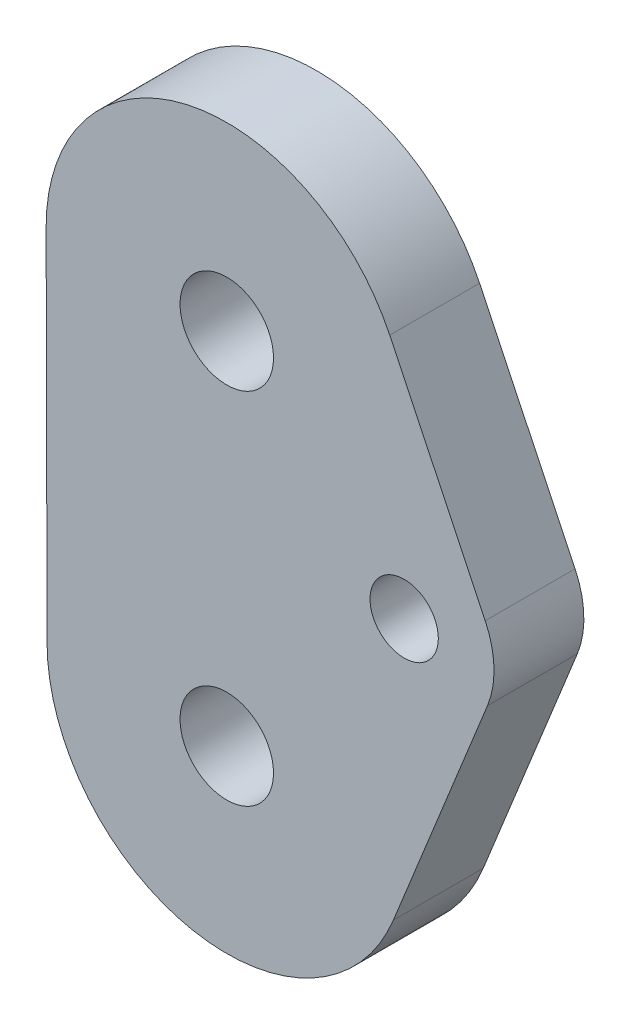
ISO-10303-21;
HEADER;
FILE_DESCRIPTION(('STEP AP214'),'2;1');
FILE_NAME('part.step','',(''),(''),'','','');
FILE_SCHEMA(('AUTOMOTIVE_DESIGN { 1 0 10303 214 1 1 1 1 }'));
ENDSEC;
DATA;
#1=APPLICATION_CONTEXT('core data for automotive mechanical design processes');
#2=APPLICATION_PROTOCOL_DEFINITION('international standard','automotive_design',2000,#1);
#3=PRODUCT_CONTEXT('',#1,'mechanical');
#4=PRODUCT('Part','Part','',(#3));
#5=PRODUCT_RELATED_PRODUCT_CATEGORY('part','',(#4));
#6=PRODUCT_DEFINITION_FORMATION('','',#4);
#7=PRODUCT_DEFINITION_CONTEXT('part definition',#1,'design');
#8=PRODUCT_DEFINITION('design','',#6,#7);
#9=PRODUCT_DEFINITION_SHAPE('','',#8);
#10=(LENGTH_UNIT() NAMED_UNIT(*) SI_UNIT(.MILLI.,.METRE.));
#11=(NAMED_UNIT(*) PLANE_ANGLE_UNIT() SI_UNIT($,.RADIAN.));
#12=(NAMED_UNIT(*) SI_UNIT($,.STERADIAN.) SOLID_ANGLE_UNIT());
#13=UNCERTAINTY_MEASURE_WITH_UNIT(LENGTH_MEASURE(1.E-05),#10,'distance_accuracy_value','');
#14=(GEOMETRIC_REPRESENTATION_CONTEXT(3) GLOBAL_UNCERTAINTY_ASSIGNED_CONTEXT((#13)) GLOBAL_UNIT_ASSIGNED_CONTEXT((#10,
#11,#12)) REPRESENTATION_CONTEXT('',''));
#15=CARTESIAN_POINT('',(0.,0.,0.));
#16=DIRECTION('',(0.,0.,1.));
#17=DIRECTION('',(1.,0.,0.));
#18=AXIS2_PLACEMENT_3D('',#15,#16,#17);
#19=CARTESIAN_POINT('',(56.9858620115287,-53.4430988360536,6.35));
#20=DIRECTION('',(0.,0.,1.));
#21=DIRECTION('',(1.,0.,0.));
#22=AXIS2_PLACEMENT_3D('',#19,#20,#21);
#23=PLANE('',#22);
#24=CARTESIAN_POINT('',(44.45,-67.508733918,6.35));
#25=DIRECTION('',(0.,0.,1.));
#26=DIRECTION('',(1.,0.,0.));
#27=AXIS2_PLACEMENT_3D('',#24,#25,#26);
#28=CIRCLE('',#27,3.30199999999999);
#29=CARTESIAN_POINT('',(47.752,-67.508733918,6.35));
#30=VERTEX_POINT('',#29);
#31=EDGE_CURVE('E187',#30,#30,#28,.T.);
#32=ORIENTED_EDGE('',*,*,#31,.F.);
#33=EDGE_LOOP('',(#32));
#34=FACE_BOUND('',#33,.T.);
#35=CARTESIAN_POINT('',(56.9858620115287,-53.4430988360536,6.35));
#36=DIRECTION('',(0.,0.,1.));
#37=DIRECTION('',(1.,0.,0.));
#38=AXIS2_PLACEMENT_3D('',#35,#36,#37);
#39=CIRCLE('',#38,6.35000000000002);
#40=CARTESIAN_POINT('',(62.8729470539659,-55.8231681004053,6.35));
#41=VERTEX_POINT('',#40);
#42=CARTESIAN_POINT('',(62.7137700058897,-50.7020096349996,6.35));
#43=VERTEX_POINT('',#42);
#44=EDGE_CURVE('E132',#41,#43,#39,.T.);
#45=ORIENTED_EDGE('',*,*,#44,.T.);
#46=DIRECTION('',(-0.431667590717168,0.902032755017486,0.));
#47=VECTOR('',#46,1.);
#48=CARTESIAN_POINT('',(55.9645204159877,-36.5984625242115,6.35));
#49=LINE('',#48,#47);
#50=CARTESIAN_POINT('',(55.9645204159877,-36.5984625242115,6.35));
#51=VERTEX_POINT('',#50);
#52=EDGE_CURVE('E90',#43,#51,#49,.T.);
#53=ORIENTED_EDGE('',*,*,#52,.T.);
#54=CARTESIAN_POINT('',(44.45,-42.108733918,6.35));
#55=DIRECTION('',(0.,0.,1.));
#56=DIRECTION('',(1.,0.,0.));
#57=AXIS2_PLACEMENT_3D('',#54,#55,#56);
#58=CIRCLE('',#57,12.7650801502929);
#59=CARTESIAN_POINT('',(31.6849617506624,-42.1414407422001,6.35));
#60=VERTEX_POINT('',#59);
#61=EDGE_CURVE('E103',#51,#60,#58,.T.);
#62=ORIENTED_EDGE('',*,*,#61,.T.);
#63=DIRECTION('',(0.00256221064145207,-0.999996717532927,0.));
#64=VECTOR('',#63,1.);
#65=CARTESIAN_POINT('',(31.7500416873318,-67.5412739931465,6.35));
#66=LINE('',#65,#64);
#67=CARTESIAN_POINT('',(31.7500416873318,-67.5412739931465,6.35));
#68=VERTEX_POINT('',#67);
#69=EDGE_CURVE('E97',#60,#68,#66,.T.);
#70=ORIENTED_EDGE('',*,*,#69,.T.);
#71=CARTESIAN_POINT('',(44.45,-67.508733918,6.35));
#72=DIRECTION('',(0.,0.,1.));
#73=DIRECTION('',(1.,0.,0.));
#74=AXIS2_PLACEMENT_3D('',#71,#72,#73);
#75=CIRCLE('',#74,12.7);
#76=CARTESIAN_POINT('',(56.2241700848745,-72.2688724467034,6.35));
#77=VERTEX_POINT('',#76);
#78=EDGE_CURVE('E101',#68,#77,#75,.T.);
#79=ORIENTED_EDGE('',*,*,#78,.T.);
#80=DIRECTION('',(0.374814057378221,0.927100006683031,0.));
#81=VECTOR('',#80,1.);
#82=CARTESIAN_POINT('',(62.8729470539659,-55.8231681004053,6.35));
#83=LINE('',#82,#81);
#84=EDGE_CURVE('E53',#77,#41,#83,.T.);
#85=ORIENTED_EDGE('',*,*,#84,.T.);
#86=EDGE_LOOP('',(#45,#53,#62,#70,#79,#85));
#87=FACE_BOUND('',#86,.T.);
#88=CARTESIAN_POINT('',(56.9858620115287,-53.4430988360536,6.35));
#89=DIRECTION('',(0.,0.,1.));
#90=DIRECTION('',(1.,0.,0.));
#91=AXIS2_PLACEMENT_3D('',#88,#89,#90);
#92=CIRCLE('',#91,2.41299999999999);
#93=CARTESIAN_POINT('',(59.3988620115286,-53.4430988360536,6.35));
#94=VERTEX_POINT('',#93);
#95=EDGE_CURVE('E125',#94,#94,#92,.T.);
#96=ORIENTED_EDGE('',*,*,#95,.F.);
#97=EDGE_LOOP('',(#96));
#98=FACE_BOUND('',#97,.T.);
#99=CARTESIAN_POINT('',(44.45,-42.108733918,6.35));
#100=DIRECTION('',(0.,0.,1.));
#101=DIRECTION('',(1.,0.,0.));
#102=AXIS2_PLACEMENT_3D('',#99,#100,#101);
#103=CIRCLE('',#102,3.30199999999999);
#104=CARTESIAN_POINT('',(47.752,-42.108733918,6.35));
#105=VERTEX_POINT('',#104);
#106=EDGE_CURVE('E178',#105,#105,#103,.T.);
#107=ORIENTED_EDGE('',*,*,#106,.F.);
#108=EDGE_LOOP('',(#107));
#109=FACE_BOUND('',#108,.T.);
#110=ADVANCED_FACE('F36',(#34,#87,#98,#109),#23,.T.);
#111=CARTESIAN_POINT('',(56.9858620115287,-53.4430988360536,0.));
#112=DIRECTION('',(0.,0.,1.));
#113=DIRECTION('',(1.,0.,0.));
#114=AXIS2_PLACEMENT_3D('',#111,#112,#113);
#115=PLANE('',#114);
#116=CARTESIAN_POINT('',(56.9858620115287,-53.4430988360536,0.));
#117=DIRECTION('',(0.,0.,1.));
#118=DIRECTION('',(1.,0.,0.));
#119=AXIS2_PLACEMENT_3D('',#116,#117,#118);
#120=CIRCLE('',#119,6.35000000000002);
#121=CARTESIAN_POINT('',(62.8729470539659,-55.8231681004053,0.));
#122=VERTEX_POINT('',#121);
#123=CARTESIAN_POINT('',(62.7137700058897,-50.7020096349996,0.));
#124=VERTEX_POINT('',#123);
#125=EDGE_CURVE('E121',#122,#124,#120,.T.);
#126=ORIENTED_EDGE('',*,*,#125,.F.);
#127=DIRECTION('',(0.374814057378221,0.927100006683031,0.));
#128=VECTOR('',#127,1.);
#129=CARTESIAN_POINT('',(62.8729470539659,-55.8231681004053,0.));
#130=LINE('',#129,#128);
#131=CARTESIAN_POINT('',(56.2241700848745,-72.2688724467034,0.));
#132=VERTEX_POINT('',#131);
#133=EDGE_CURVE('E82',#132,#122,#130,.T.);
#134=ORIENTED_EDGE('',*,*,#133,.F.);
#135=CARTESIAN_POINT('',(44.45,-67.508733918,0.));
#136=DIRECTION('',(0.,0.,1.));
#137=DIRECTION('',(1.,0.,0.));
#138=AXIS2_PLACEMENT_3D('',#135,#136,#137);
#139=CIRCLE('',#138,12.7);
#140=CARTESIAN_POINT('',(31.7500416873318,-67.5412739931465,0.));
#141=VERTEX_POINT('',#140);
#142=EDGE_CURVE('E76',#141,#132,#139,.T.);
#143=ORIENTED_EDGE('',*,*,#142,.F.);
#144=DIRECTION('',(0.00256221064145207,-0.999996717532927,0.));
#145=VECTOR('',#144,1.);
#146=CARTESIAN_POINT('',(31.7500416873318,-67.5412739931465,0.));
#147=LINE('',#146,#145);
#148=CARTESIAN_POINT('',(31.6849617506624,-42.1414407422001,0.));
#149=VERTEX_POINT('',#148);
#150=EDGE_CURVE('E111',#149,#141,#147,.T.);
#151=ORIENTED_EDGE('',*,*,#150,.F.);
#152=CARTESIAN_POINT('',(44.45,-42.108733918,0.));
#153=DIRECTION('',(0.,0.,1.));
#154=DIRECTION('',(1.,0.,0.));
#155=AXIS2_PLACEMENT_3D('',#152,#153,#154);
#156=CIRCLE('',#155,12.7650801502929);
#157=CARTESIAN_POINT('',(55.9645204159877,-36.5984625242115,0.));
#158=VERTEX_POINT('',#157);
#159=EDGE_CURVE('E127',#158,#149,#156,.T.);
#160=ORIENTED_EDGE('',*,*,#159,.F.);
#161=DIRECTION('',(-0.431667590717168,0.902032755017486,0.));
#162=VECTOR('',#161,1.);
#163=CARTESIAN_POINT('',(55.9645204159877,-36.5984625242115,0.));
#164=LINE('',#163,#162);
#165=EDGE_CURVE('E124',#124,#158,#164,.T.);
#166=ORIENTED_EDGE('',*,*,#165,.F.);
#167=EDGE_LOOP('',(#126,#134,#143,#151,#160,#166));
#168=FACE_BOUND('',#167,.T.);
#169=CARTESIAN_POINT('',(56.9858620115287,-53.4430988360536,0.));
#170=DIRECTION('',(0.,0.,1.));
#171=DIRECTION('',(1.,0.,0.));
#172=AXIS2_PLACEMENT_3D('',#169,#170,#171);
#173=CIRCLE('',#172,2.41299999999999);
#174=CARTESIAN_POINT('',(59.3988620115286,-53.4430988360536,0.));
#175=VERTEX_POINT('',#174);
#176=EDGE_CURVE('E190',#175,#175,#173,.T.);
#177=ORIENTED_EDGE('',*,*,#176,.T.);
#178=EDGE_LOOP('',(#177));
#179=FACE_BOUND('',#178,.T.);
#180=CARTESIAN_POINT('',(44.45,-67.508733918,0.));
#181=DIRECTION('',(0.,0.,1.));
#182=DIRECTION('',(1.,0.,0.));
#183=AXIS2_PLACEMENT_3D('',#180,#181,#182);
#184=CIRCLE('',#183,3.30199999999999);
#185=CARTESIAN_POINT('',(47.752,-67.508733918,0.));
#186=VERTEX_POINT('',#185);
#187=EDGE_CURVE('E184',#186,#186,#184,.T.);
#188=ORIENTED_EDGE('',*,*,#187,.T.);
#189=EDGE_LOOP('',(#188));
#190=FACE_BOUND('',#189,.T.);
#191=CARTESIAN_POINT('',(44.45,-42.108733918,0.));
#192=DIRECTION('',(0.,0.,1.));
#193=DIRECTION('',(1.,0.,0.));
#194=AXIS2_PLACEMENT_3D('',#191,#192,#193);
#195=CIRCLE('',#194,3.30199999999999);
#196=CARTESIAN_POINT('',(47.752,-42.108733918,0.));
#197=VERTEX_POINT('',#196);
#198=EDGE_CURVE('E181',#197,#197,#195,.T.);
#199=ORIENTED_EDGE('',*,*,#198,.T.);
#200=EDGE_LOOP('',(#199));
#201=FACE_BOUND('',#200,.T.);
#202=ADVANCED_FACE('F141',(#168,#179,#190,#201),#115,.F.);
#203=CARTESIAN_POINT('',(56.9858620115287,-53.4430988360536,6.35));
#204=DIRECTION('',(0.,0.,-1.));
#205=DIRECTION('',(-1.,0.,0.));
#206=AXIS2_PLACEMENT_3D('',#203,#204,#205);
#207=CYLINDRICAL_SURFACE('',#206,6.35000000000002);
#208=ORIENTED_EDGE('',*,*,#125,.T.);
#209=DIRECTION('',(0.,0.,-1.));
#210=VECTOR('',#209,1.);
#211=CARTESIAN_POINT('',(62.7137700058897,-50.7020096349996,6.35));
#212=LINE('',#211,#210);
#213=EDGE_CURVE('E11',#43,#124,#212,.T.);
#214=ORIENTED_EDGE('',*,*,#213,.F.);
#215=ORIENTED_EDGE('',*,*,#44,.F.);
#216=DIRECTION('',(0.,0.,-1.));
#217=VECTOR('',#216,1.);
#218=CARTESIAN_POINT('',(62.8729470539659,-55.8231681004053,6.35));
#219=LINE('',#218,#217);
#220=EDGE_CURVE('E117',#41,#122,#219,.T.);
#221=ORIENTED_EDGE('',*,*,#220,.T.);
#222=EDGE_LOOP('',(#208,#214,#215,#221));
#223=FACE_BOUND('',#222,.T.);
#224=ADVANCED_FACE('F38',(#223),#207,.T.);
#225=CARTESIAN_POINT('',(55.9645204159877,-36.5984625242115,6.35));
#226=DIRECTION('',(-0.902032755017486,-0.431667590717168,0.));
#227=DIRECTION('',(0.431667590717168,-0.902032755017486,0.));
#228=AXIS2_PLACEMENT_3D('',#225,#226,#227);
#229=PLANE('',#228);
#230=ORIENTED_EDGE('',*,*,#165,.T.);
#231=DIRECTION('',(0.,0.,-1.));
#232=VECTOR('',#231,1.);
#233=CARTESIAN_POINT('',(55.9645204159877,-36.5984625242115,6.35));
#234=LINE('',#233,#232);
#235=EDGE_CURVE('E45',#51,#158,#234,.T.);
#236=ORIENTED_EDGE('',*,*,#235,.F.);
#237=ORIENTED_EDGE('',*,*,#52,.F.);
#238=ORIENTED_EDGE('',*,*,#213,.T.);
#239=EDGE_LOOP('',(#230,#236,#237,#238));
#240=FACE_BOUND('',#239,.T.);
#241=ADVANCED_FACE('F240',(#240),#229,.F.);
#242=CARTESIAN_POINT('',(44.45,-42.108733918,6.35));
#243=DIRECTION('',(0.,0.,-1.));
#244=DIRECTION('',(-1.,0.,0.));
#245=AXIS2_PLACEMENT_3D('',#242,#243,#244);
#246=CYLINDRICAL_SURFACE('',#245,12.7650801502929);
#247=ORIENTED_EDGE('',*,*,#159,.T.);
#248=DIRECTION('',(0.,0.,-1.));
#249=VECTOR('',#248,1.);
#250=CARTESIAN_POINT('',(31.6849617506624,-42.1414407422001,6.35));
#251=LINE('',#250,#249);
#252=EDGE_CURVE('E112',#60,#149,#251,.T.);
#253=ORIENTED_EDGE('',*,*,#252,.F.);
#254=ORIENTED_EDGE('',*,*,#61,.F.);
#255=ORIENTED_EDGE('',*,*,#235,.T.);
#256=EDGE_LOOP('',(#247,#253,#254,#255));
#257=FACE_BOUND('',#256,.T.);
#258=ADVANCED_FACE('F138',(#257),#246,.T.);
#259=CARTESIAN_POINT('',(31.7500416873318,-67.5412739931465,6.35));
#260=DIRECTION('',(0.999996717532927,0.00256221064145207,0.));
#261=DIRECTION('',(-0.00256221064145207,0.999996717532927,0.));
#262=AXIS2_PLACEMENT_3D('',#259,#260,#261);
#263=PLANE('',#262);
#264=ORIENTED_EDGE('',*,*,#150,.T.);
#265=DIRECTION('',(0.,0.,-1.));
#266=VECTOR('',#265,1.);
#267=CARTESIAN_POINT('',(31.7500416873318,-67.5412739931465,6.35));
#268=LINE('',#267,#266);
#269=EDGE_CURVE('E108',#68,#141,#268,.T.);
#270=ORIENTED_EDGE('',*,*,#269,.F.);
#271=ORIENTED_EDGE('',*,*,#69,.F.);
#272=ORIENTED_EDGE('',*,*,#252,.T.);
#273=EDGE_LOOP('',(#264,#270,#271,#272));
#274=FACE_BOUND('',#273,.T.);
#275=ADVANCED_FACE('F109',(#274),#263,.F.);
#276=CARTESIAN_POINT('',(44.45,-67.508733918,6.35));
#277=DIRECTION('',(0.,0.,-1.));
#278=DIRECTION('',(-1.,0.,0.));
#279=AXIS2_PLACEMENT_3D('',#276,#277,#278);
#280=CYLINDRICAL_SURFACE('',#279,12.7);
#281=ORIENTED_EDGE('',*,*,#142,.T.);
#282=DIRECTION('',(0.,0.,-1.));
#283=VECTOR('',#282,1.);
#284=CARTESIAN_POINT('',(56.2241700848745,-72.2688724467034,6.35));
#285=LINE('',#284,#283);
#286=EDGE_CURVE('E113',#77,#132,#285,.T.);
#287=ORIENTED_EDGE('',*,*,#286,.F.);
#288=ORIENTED_EDGE('',*,*,#78,.F.);
#289=ORIENTED_EDGE('',*,*,#269,.T.);
#290=EDGE_LOOP('',(#281,#287,#288,#289));
#291=FACE_BOUND('',#290,.T.);
#292=ADVANCED_FACE('F115',(#291),#280,.T.);
#293=CARTESIAN_POINT('',(62.8729470539659,-55.8231681004053,6.35));
#294=DIRECTION('',(-0.927100006683031,0.374814057378221,0.));
#295=DIRECTION('',(-0.374814057378221,-0.927100006683031,0.));
#296=AXIS2_PLACEMENT_3D('',#293,#294,#295);
#297=PLANE('',#296);
#298=ORIENTED_EDGE('',*,*,#133,.T.);
#299=ORIENTED_EDGE('',*,*,#220,.F.);
#300=ORIENTED_EDGE('',*,*,#84,.F.);
#301=ORIENTED_EDGE('',*,*,#286,.T.);
#302=EDGE_LOOP('',(#298,#299,#300,#301));
#303=FACE_BOUND('',#302,.T.);
#304=ADVANCED_FACE('F146',(#303),#297,.F.);
#305=CARTESIAN_POINT('',(56.9858620115287,-53.4430988360536,6.35));
#306=DIRECTION('',(0.,0.,-1.));
#307=DIRECTION('',(-1.,0.,0.));
#308=AXIS2_PLACEMENT_3D('',#305,#306,#307);
#309=CYLINDRICAL_SURFACE('',#308,2.41299999999999);
#310=ORIENTED_EDGE('',*,*,#95,.T.);
#311=EDGE_LOOP('',(#310));
#312=FACE_BOUND('',#311,.T.);
#313=ORIENTED_EDGE('',*,*,#176,.F.);
#314=EDGE_LOOP('',(#313));
#315=FACE_BOUND('',#314,.T.);
#316=ADVANCED_FACE('F148',(#312,#315),#309,.F.);
#317=CARTESIAN_POINT('',(44.45,-67.508733918,6.35));
#318=DIRECTION('',(0.,0.,-1.));
#319=DIRECTION('',(-1.,0.,0.));
#320=AXIS2_PLACEMENT_3D('',#317,#318,#319);
#321=CYLINDRICAL_SURFACE('',#320,3.30199999999999);
#322=ORIENTED_EDGE('',*,*,#31,.T.);
#323=EDGE_LOOP('',(#322));
#324=FACE_BOUND('',#323,.T.);
#325=ORIENTED_EDGE('',*,*,#187,.F.);
#326=EDGE_LOOP('',(#325));
#327=FACE_BOUND('',#326,.T.);
#328=ADVANCED_FACE('F154',(#324,#327),#321,.F.);
#329=CARTESIAN_POINT('',(44.45,-42.108733918,6.35));
#330=DIRECTION('',(0.,0.,-1.));
#331=DIRECTION('',(-1.,0.,0.));
#332=AXIS2_PLACEMENT_3D('',#329,#330,#331);
#333=CYLINDRICAL_SURFACE('',#332,3.30199999999999);
#334=ORIENTED_EDGE('',*,*,#106,.T.);
#335=EDGE_LOOP('',(#334));
#336=FACE_BOUND('',#335,.T.);
#337=ORIENTED_EDGE('',*,*,#198,.F.);
#338=EDGE_LOOP('',(#337));
#339=FACE_BOUND('',#338,.T.);
#340=ADVANCED_FACE('F169',(#336,#339),#333,.F.);
#341=CLOSED_SHELL('',(#110,#202,#224,#241,#258,#275,#292,#304,#316,#328,#340));
#342=MANIFOLD_SOLID_BREP('B2',#341);
#343=ADVANCED_BREP_SHAPE_REPRESENTATION('',(#18,#342),#14);
#344=SHAPE_DEFINITION_REPRESENTATION(#9,#343);
ENDSEC;
END-ISO-10303-21;
